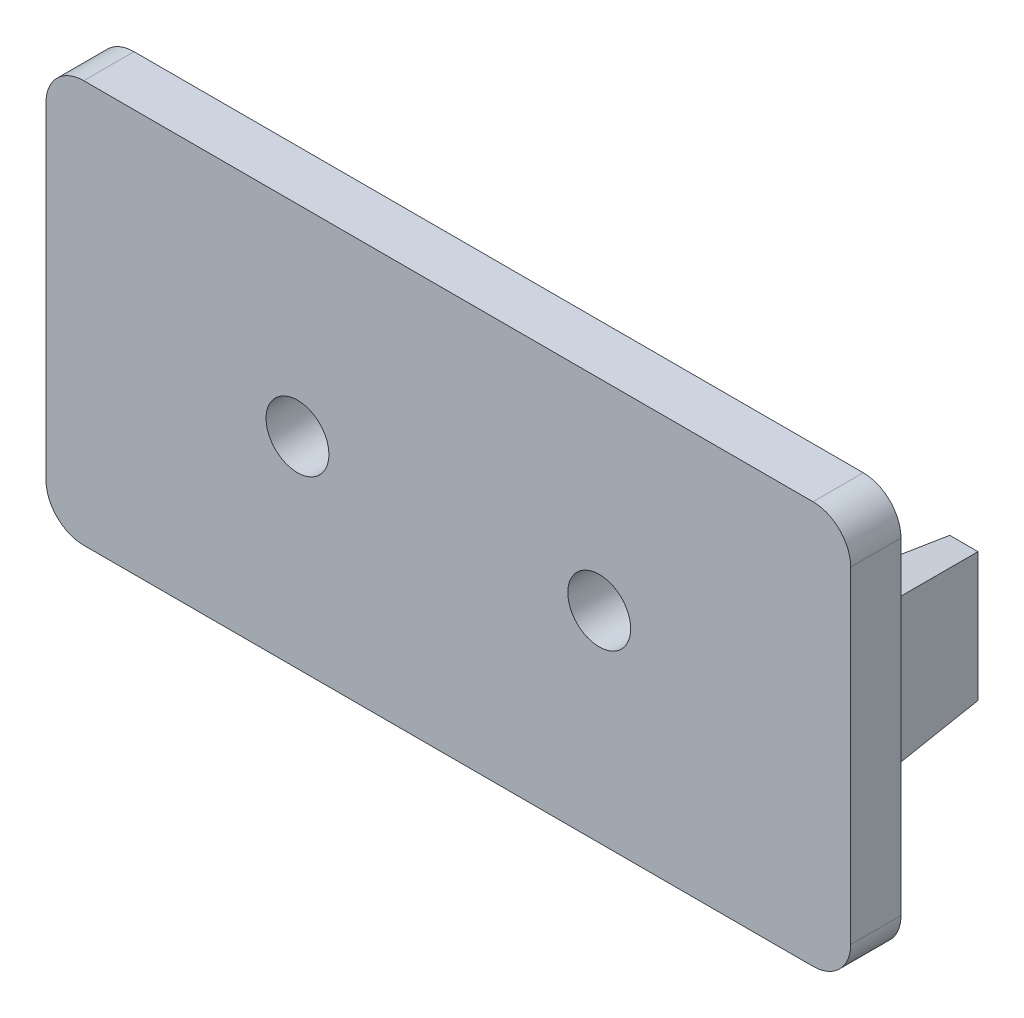
ISO-10303-21;
HEADER;
FILE_DESCRIPTION(('STEP AP214'),'2;1');
FILE_NAME('part.step','',(''),(''),'','','');
FILE_SCHEMA(('AUTOMOTIVE_DESIGN { 1 0 10303 214 1 1 1 1 }'));
ENDSEC;
DATA;
#1=APPLICATION_CONTEXT('core data for automotive mechanical design processes');
#2=APPLICATION_PROTOCOL_DEFINITION('international standard','automotive_design',2000,#1);
#3=PRODUCT_CONTEXT('',#1,'mechanical');
#4=PRODUCT('Part','Part','',(#3));
#5=PRODUCT_RELATED_PRODUCT_CATEGORY('part','',(#4));
#6=PRODUCT_DEFINITION_FORMATION('','',#4);
#7=PRODUCT_DEFINITION_CONTEXT('part definition',#1,'design');
#8=PRODUCT_DEFINITION('design','',#6,#7);
#9=PRODUCT_DEFINITION_SHAPE('','',#8);
#10=(LENGTH_UNIT() NAMED_UNIT(*) SI_UNIT(.MILLI.,.METRE.));
#11=(NAMED_UNIT(*) PLANE_ANGLE_UNIT() SI_UNIT($,.RADIAN.));
#12=(NAMED_UNIT(*) SI_UNIT($,.STERADIAN.) SOLID_ANGLE_UNIT());
#13=UNCERTAINTY_MEASURE_WITH_UNIT(LENGTH_MEASURE(1.E-05),#10,'distance_accuracy_value','');
#14=(GEOMETRIC_REPRESENTATION_CONTEXT(3) GLOBAL_UNCERTAINTY_ASSIGNED_CONTEXT((#13)) GLOBAL_UNIT_ASSIGNED_CONTEXT((#10,
#11,#12)) REPRESENTATION_CONTEXT('',''));
#15=CARTESIAN_POINT('',(0.,0.,0.));
#16=DIRECTION('',(0.,0.,1.));
#17=DIRECTION('',(1.,0.,0.));
#18=AXIS2_PLACEMENT_3D('',#15,#16,#17);
#19=CARTESIAN_POINT('',(0.,0.,0.));
#20=DIRECTION('',(0.,0.,1.));
#21=DIRECTION('',(1.,0.,0.));
#22=AXIS2_PLACEMENT_3D('',#19,#20,#21);
#23=PLANE('',#22);
#24=DIRECTION('',(0.,-1.,0.));
#25=VECTOR('',#24,1.);
#26=CARTESIAN_POINT('',(14.5,3.,0.));
#27=LINE('',#26,#25);
#28=CARTESIAN_POINT('',(14.5,3.,0.));
#29=VERTEX_POINT('',#28);
#30=CARTESIAN_POINT('',(14.5,-3.,0.));
#31=VERTEX_POINT('',#30);
#32=EDGE_CURVE('E186',#29,#31,#27,.T.);
#33=ORIENTED_EDGE('',*,*,#32,.F.);
#34=DIRECTION('',(1.,0.,0.));
#35=VECTOR('',#34,1.);
#36=CARTESIAN_POINT('',(14.5,3.,0.));
#37=LINE('',#36,#35);
#38=CARTESIAN_POINT('',(12.5,3.,0.));
#39=VERTEX_POINT('',#38);
#40=EDGE_CURVE('E195',#39,#29,#37,.T.);
#41=ORIENTED_EDGE('',*,*,#40,.F.);
#42=DIRECTION('',(0.,1.,0.));
#43=VECTOR('',#42,1.);
#44=CARTESIAN_POINT('',(12.5,3.,0.));
#45=LINE('',#44,#43);
#46=CARTESIAN_POINT('',(12.5,-3.,0.));
#47=VERTEX_POINT('',#46);
#48=EDGE_CURVE('E192',#47,#39,#45,.T.);
#49=ORIENTED_EDGE('',*,*,#48,.F.);
#50=DIRECTION('',(-1.,0.,0.));
#51=VECTOR('',#50,1.);
#52=CARTESIAN_POINT('',(14.5,-3.,0.));
#53=LINE('',#52,#51);
#54=EDGE_CURVE('E189',#31,#47,#53,.T.);
#55=ORIENTED_EDGE('',*,*,#54,.F.);
#56=EDGE_LOOP('',(#33,#41,#49,#55));
#57=FACE_BOUND('',#56,.T.);
#58=DIRECTION('',(1.,0.,0.));
#59=VECTOR('',#58,1.);
#60=CARTESIAN_POINT('',(-16.,-8.,0.));
#61=LINE('',#60,#59);
#62=CARTESIAN_POINT('',(-14.5,-8.,0.));
#63=VERTEX_POINT('',#62);
#64=CARTESIAN_POINT('',(14.5,-8.,0.));
#65=VERTEX_POINT('',#64);
#66=EDGE_CURVE('E246',#63,#65,#61,.T.);
#67=ORIENTED_EDGE('',*,*,#66,.F.);
#68=CARTESIAN_POINT('',(-14.5,-6.5,0.));
#69=DIRECTION('',(0.,0.,1.));
#70=DIRECTION('',(1.,0.,0.));
#71=AXIS2_PLACEMENT_3D('',#68,#69,#70);
#72=CIRCLE('',#71,1.5);
#73=CARTESIAN_POINT('',(-16.,-6.5,0.));
#74=VERTEX_POINT('',#73);
#75=EDGE_CURVE('E263',#63,#74,#72,.F.);
#76=ORIENTED_EDGE('',*,*,#75,.T.);
#77=DIRECTION('',(0.,-1.,0.));
#78=VECTOR('',#77,1.);
#79=CARTESIAN_POINT('',(-16.,8.,0.));
#80=LINE('',#79,#78);
#81=CARTESIAN_POINT('',(-16.,6.5,0.));
#82=VERTEX_POINT('',#81);
#83=EDGE_CURVE('E229',#82,#74,#80,.T.);
#84=ORIENTED_EDGE('',*,*,#83,.F.);
#85=CARTESIAN_POINT('',(-14.5,6.5,0.));
#86=DIRECTION('',(0.,0.,1.));
#87=DIRECTION('',(1.,0.,0.));
#88=AXIS2_PLACEMENT_3D('',#85,#86,#87);
#89=CIRCLE('',#88,1.5);
#90=CARTESIAN_POINT('',(-14.5,8.,0.));
#91=VERTEX_POINT('',#90);
#92=EDGE_CURVE('E261',#82,#91,#89,.F.);
#93=ORIENTED_EDGE('',*,*,#92,.T.);
#94=DIRECTION('',(-1.,0.,0.));
#95=VECTOR('',#94,1.);
#96=CARTESIAN_POINT('',(-16.,8.,0.));
#97=LINE('',#96,#95);
#98=CARTESIAN_POINT('',(14.5,8.,0.));
#99=VERTEX_POINT('',#98);
#100=EDGE_CURVE('E236',#99,#91,#97,.T.);
#101=ORIENTED_EDGE('',*,*,#100,.F.);
#102=CARTESIAN_POINT('',(14.5,6.5,0.));
#103=DIRECTION('',(0.,0.,1.));
#104=DIRECTION('',(1.,0.,0.));
#105=AXIS2_PLACEMENT_3D('',#102,#103,#104);
#106=CIRCLE('',#105,1.5);
#107=CARTESIAN_POINT('',(16.,6.5,0.));
#108=VERTEX_POINT('',#107);
#109=EDGE_CURVE('E259',#99,#108,#106,.F.);
#110=ORIENTED_EDGE('',*,*,#109,.T.);
#111=DIRECTION('',(0.,1.,0.));
#112=VECTOR('',#111,1.);
#113=CARTESIAN_POINT('',(16.,8.,0.));
#114=LINE('',#113,#112);
#115=CARTESIAN_POINT('',(16.,-6.5,0.));
#116=VERTEX_POINT('',#115);
#117=EDGE_CURVE('E249',#116,#108,#114,.T.);
#118=ORIENTED_EDGE('',*,*,#117,.F.);
#119=CARTESIAN_POINT('',(14.5,-6.5,0.));
#120=DIRECTION('',(0.,0.,1.));
#121=DIRECTION('',(1.,0.,0.));
#122=AXIS2_PLACEMENT_3D('',#119,#120,#121);
#123=CIRCLE('',#122,1.5);
#124=EDGE_CURVE('E257',#116,#65,#123,.F.);
#125=ORIENTED_EDGE('',*,*,#124,.T.);
#126=EDGE_LOOP('',(#67,#76,#84,#93,#101,#110,#118,#125));
#127=FACE_BOUND('',#126,.T.);
#128=CARTESIAN_POINT('',(6.,0.,0.));
#129=DIRECTION('',(0.,0.,1.));
#130=DIRECTION('',(1.,0.,0.));
#131=AXIS2_PLACEMENT_3D('',#128,#129,#130);
#132=CIRCLE('',#131,1.25);
#133=CARTESIAN_POINT('',(7.25,0.,0.));
#134=VERTEX_POINT('',#133);
#135=EDGE_CURVE('E223',#134,#134,#132,.T.);
#136=ORIENTED_EDGE('',*,*,#135,.T.);
#137=EDGE_LOOP('',(#136));
#138=FACE_BOUND('',#137,.T.);
#139=CARTESIAN_POINT('',(-6.,0.,0.));
#140=DIRECTION('',(0.,0.,1.));
#141=DIRECTION('',(1.,0.,0.));
#142=AXIS2_PLACEMENT_3D('',#139,#140,#141);
#143=CIRCLE('',#142,1.25);
#144=CARTESIAN_POINT('',(-4.75,0.,0.));
#145=VERTEX_POINT('',#144);
#146=EDGE_CURVE('E202',#145,#145,#143,.T.);
#147=ORIENTED_EDGE('',*,*,#146,.T.);
#148=EDGE_LOOP('',(#147));
#149=FACE_BOUND('',#148,.T.);
#150=DIRECTION('',(0.,-1.,0.));
#151=VECTOR('',#150,1.);
#152=CARTESIAN_POINT('',(-12.5,3.,0.));
#153=LINE('',#152,#151);
#154=CARTESIAN_POINT('',(-12.5,3.,0.));
#155=VERTEX_POINT('',#154);
#156=CARTESIAN_POINT('',(-12.5,-3.,0.));
#157=VERTEX_POINT('',#156);
#158=EDGE_CURVE('E146',#155,#157,#153,.T.);
#159=ORIENTED_EDGE('',*,*,#158,.F.);
#160=DIRECTION('',(1.,0.,0.));
#161=VECTOR('',#160,1.);
#162=CARTESIAN_POINT('',(-12.5,3.,0.));
#163=LINE('',#162,#161);
#164=CARTESIAN_POINT('',(-14.5,3.,0.));
#165=VERTEX_POINT('',#164);
#166=EDGE_CURVE('E148',#165,#155,#163,.T.);
#167=ORIENTED_EDGE('',*,*,#166,.F.);
#168=DIRECTION('',(0.,1.,0.));
#169=VECTOR('',#168,1.);
#170=CARTESIAN_POINT('',(-14.5,3.,0.));
#171=LINE('',#170,#169);
#172=CARTESIAN_POINT('',(-14.5,-3.,0.));
#173=VERTEX_POINT('',#172);
#174=EDGE_CURVE('E167',#173,#165,#171,.T.);
#175=ORIENTED_EDGE('',*,*,#174,.F.);
#176=DIRECTION('',(-1.,0.,0.));
#177=VECTOR('',#176,1.);
#178=CARTESIAN_POINT('',(-12.5,-3.,0.));
#179=LINE('',#178,#177);
#180=EDGE_CURVE('E151',#157,#173,#179,.T.);
#181=ORIENTED_EDGE('',*,*,#180,.F.);
#182=EDGE_LOOP('',(#159,#167,#175,#181));
#183=FACE_BOUND('',#182,.T.);
#184=ADVANCED_FACE('F33',(#57,#127,#138,#149,#183),#23,.F.);
#185=CARTESIAN_POINT('',(0.,0.,2.));
#186=DIRECTION('',(0.,0.,1.));
#187=DIRECTION('',(1.,0.,0.));
#188=AXIS2_PLACEMENT_3D('',#185,#186,#187);
#189=PLANE('',#188);
#190=CARTESIAN_POINT('',(6.,0.,2.));
#191=DIRECTION('',(0.,0.,1.));
#192=DIRECTION('',(1.,0.,0.));
#193=AXIS2_PLACEMENT_3D('',#190,#191,#192);
#194=CIRCLE('',#193,1.25);
#195=CARTESIAN_POINT('',(7.25,0.,2.));
#196=VERTEX_POINT('',#195);
#197=EDGE_CURVE('E226',#196,#196,#194,.T.);
#198=ORIENTED_EDGE('',*,*,#197,.F.);
#199=EDGE_LOOP('',(#198));
#200=FACE_BOUND('',#199,.T.);
#201=DIRECTION('',(0.,-1.,0.));
#202=VECTOR('',#201,1.);
#203=CARTESIAN_POINT('',(-16.,8.,2.));
#204=LINE('',#203,#202);
#205=CARTESIAN_POINT('',(-16.,6.5,2.));
#206=VERTEX_POINT('',#205);
#207=CARTESIAN_POINT('',(-16.,-6.5,2.));
#208=VERTEX_POINT('',#207);
#209=EDGE_CURVE('E232',#206,#208,#204,.T.);
#210=ORIENTED_EDGE('',*,*,#209,.T.);
#211=CARTESIAN_POINT('',(-14.5,-6.5,2.));
#212=DIRECTION('',(0.,0.,1.));
#213=DIRECTION('',(1.,0.,0.));
#214=AXIS2_PLACEMENT_3D('',#211,#212,#213);
#215=CIRCLE('',#214,1.5);
#216=CARTESIAN_POINT('',(-14.5,-8.,2.));
#217=VERTEX_POINT('',#216);
#218=EDGE_CURVE('E275',#208,#217,#215,.T.);
#219=ORIENTED_EDGE('',*,*,#218,.T.);
#220=DIRECTION('',(1.,0.,0.));
#221=VECTOR('',#220,1.);
#222=CARTESIAN_POINT('',(-16.,-8.,2.));
#223=LINE('',#222,#221);
#224=CARTESIAN_POINT('',(14.5,-8.,2.));
#225=VERTEX_POINT('',#224);
#226=EDGE_CURVE('E235',#217,#225,#223,.T.);
#227=ORIENTED_EDGE('',*,*,#226,.T.);
#228=CARTESIAN_POINT('',(14.5,-6.5,2.));
#229=DIRECTION('',(0.,0.,1.));
#230=DIRECTION('',(1.,0.,0.));
#231=AXIS2_PLACEMENT_3D('',#228,#229,#230);
#232=CIRCLE('',#231,1.5);
#233=CARTESIAN_POINT('',(16.,-6.5,2.));
#234=VERTEX_POINT('',#233);
#235=EDGE_CURVE('E270',#225,#234,#232,.T.);
#236=ORIENTED_EDGE('',*,*,#235,.T.);
#237=DIRECTION('',(0.,1.,0.));
#238=VECTOR('',#237,1.);
#239=CARTESIAN_POINT('',(16.,8.,2.));
#240=LINE('',#239,#238);
#241=CARTESIAN_POINT('',(16.,6.5,2.));
#242=VERTEX_POINT('',#241);
#243=EDGE_CURVE('E239',#234,#242,#240,.T.);
#244=ORIENTED_EDGE('',*,*,#243,.T.);
#245=CARTESIAN_POINT('',(14.5,6.5,2.));
#246=DIRECTION('',(0.,0.,1.));
#247=DIRECTION('',(1.,0.,0.));
#248=AXIS2_PLACEMENT_3D('',#245,#246,#247);
#249=CIRCLE('',#248,1.5);
#250=CARTESIAN_POINT('',(14.5,8.,2.));
#251=VERTEX_POINT('',#250);
#252=EDGE_CURVE('E55',#242,#251,#249,.T.);
#253=ORIENTED_EDGE('',*,*,#252,.T.);
#254=DIRECTION('',(-1.,0.,0.));
#255=VECTOR('',#254,1.);
#256=CARTESIAN_POINT('',(-16.,8.,2.));
#257=LINE('',#256,#255);
#258=CARTESIAN_POINT('',(-14.5,8.,2.));
#259=VERTEX_POINT('',#258);
#260=EDGE_CURVE('E241',#251,#259,#257,.T.);
#261=ORIENTED_EDGE('',*,*,#260,.T.);
#262=CARTESIAN_POINT('',(-14.5,6.5,2.));
#263=DIRECTION('',(0.,0.,1.));
#264=DIRECTION('',(1.,0.,0.));
#265=AXIS2_PLACEMENT_3D('',#262,#263,#264);
#266=CIRCLE('',#265,1.5);
#267=EDGE_CURVE('E273',#259,#206,#266,.T.);
#268=ORIENTED_EDGE('',*,*,#267,.T.);
#269=EDGE_LOOP('',(#210,#219,#227,#236,#244,#253,#261,#268));
#270=FACE_BOUND('',#269,.T.);
#271=CARTESIAN_POINT('',(-6.,0.,2.));
#272=DIRECTION('',(0.,0.,1.));
#273=DIRECTION('',(1.,0.,0.));
#274=AXIS2_PLACEMENT_3D('',#271,#272,#273);
#275=CIRCLE('',#274,1.25);
#276=CARTESIAN_POINT('',(-4.75,0.,2.));
#277=VERTEX_POINT('',#276);
#278=EDGE_CURVE('E220',#277,#277,#275,.T.);
#279=ORIENTED_EDGE('',*,*,#278,.F.);
#280=EDGE_LOOP('',(#279));
#281=FACE_BOUND('',#280,.T.);
#282=ADVANCED_FACE('F298',(#200,#270,#281),#189,.T.);
#283=CARTESIAN_POINT('',(-16.,8.,2.));
#284=DIRECTION('',(1.,0.,0.));
#285=DIRECTION('',(0.,1.,0.));
#286=AXIS2_PLACEMENT_3D('',#283,#284,#285);
#287=PLANE('',#286);
#288=ORIENTED_EDGE('',*,*,#83,.T.);
#289=DIRECTION('',(0.,0.,-1.));
#290=VECTOR('',#289,1.);
#291=CARTESIAN_POINT('',(-16.,-6.5,2.));
#292=LINE('',#291,#290);
#293=EDGE_CURVE('E268',#74,#208,#292,.F.);
#294=ORIENTED_EDGE('',*,*,#293,.T.);
#295=ORIENTED_EDGE('',*,*,#209,.F.);
#296=DIRECTION('',(0.,0.,-1.));
#297=VECTOR('',#296,1.);
#298=CARTESIAN_POINT('',(-16.,6.5,2.));
#299=LINE('',#298,#297);
#300=EDGE_CURVE('E265',#206,#82,#299,.T.);
#301=ORIENTED_EDGE('',*,*,#300,.T.);
#302=EDGE_LOOP('',(#288,#294,#295,#301));
#303=FACE_BOUND('',#302,.T.);
#304=ADVANCED_FACE('F306',(#303),#287,.F.);
#305=CARTESIAN_POINT('',(-16.,-8.,2.));
#306=DIRECTION('',(0.,1.,0.));
#307=DIRECTION('',(0.,0.,1.));
#308=AXIS2_PLACEMENT_3D('',#305,#306,#307);
#309=PLANE('',#308);
#310=ORIENTED_EDGE('',*,*,#226,.F.);
#311=DIRECTION('',(0.,0.,-1.));
#312=VECTOR('',#311,1.);
#313=CARTESIAN_POINT('',(-14.5,-8.,2.));
#314=LINE('',#313,#312);
#315=EDGE_CURVE('E254',#217,#63,#314,.T.);
#316=ORIENTED_EDGE('',*,*,#315,.T.);
#317=ORIENTED_EDGE('',*,*,#66,.T.);
#318=DIRECTION('',(0.,0.,-1.));
#319=VECTOR('',#318,1.);
#320=CARTESIAN_POINT('',(14.5,-8.,2.));
#321=LINE('',#320,#319);
#322=EDGE_CURVE('E243',#65,#225,#321,.F.);
#323=ORIENTED_EDGE('',*,*,#322,.T.);
#324=EDGE_LOOP('',(#310,#316,#317,#323));
#325=FACE_BOUND('',#324,.T.);
#326=ADVANCED_FACE('F314',(#325),#309,.F.);
#327=CARTESIAN_POINT('',(16.,8.,2.));
#328=DIRECTION('',(-1.,0.,0.));
#329=DIRECTION('',(0.,-1.,0.));
#330=AXIS2_PLACEMENT_3D('',#327,#328,#329);
#331=PLANE('',#330);
#332=ORIENTED_EDGE('',*,*,#117,.T.);
#333=DIRECTION('',(0.,0.,-1.));
#334=VECTOR('',#333,1.);
#335=CARTESIAN_POINT('',(16.,6.5,2.));
#336=LINE('',#335,#334);
#337=EDGE_CURVE('E11',#108,#242,#336,.F.);
#338=ORIENTED_EDGE('',*,*,#337,.T.);
#339=ORIENTED_EDGE('',*,*,#243,.F.);
#340=DIRECTION('',(0.,0.,-1.));
#341=VECTOR('',#340,1.);
#342=CARTESIAN_POINT('',(16.,-6.5,2.));
#343=LINE('',#342,#341);
#344=EDGE_CURVE('E41',#234,#116,#343,.T.);
#345=ORIENTED_EDGE('',*,*,#344,.T.);
#346=EDGE_LOOP('',(#332,#338,#339,#345));
#347=FACE_BOUND('',#346,.T.);
#348=ADVANCED_FACE('F285',(#347),#331,.F.);
#349=CARTESIAN_POINT('',(-16.,8.,2.));
#350=DIRECTION('',(0.,-1.,0.));
#351=DIRECTION('',(0.,0.,-1.));
#352=AXIS2_PLACEMENT_3D('',#349,#350,#351);
#353=PLANE('',#352);
#354=ORIENTED_EDGE('',*,*,#100,.T.);
#355=DIRECTION('',(0.,0.,-1.));
#356=VECTOR('',#355,1.);
#357=CARTESIAN_POINT('',(-14.5,8.,2.));
#358=LINE('',#357,#356);
#359=EDGE_CURVE('E48',#91,#259,#358,.F.);
#360=ORIENTED_EDGE('',*,*,#359,.T.);
#361=ORIENTED_EDGE('',*,*,#260,.F.);
#362=DIRECTION('',(0.,0.,-1.));
#363=VECTOR('',#362,1.);
#364=CARTESIAN_POINT('',(14.5,8.,2.));
#365=LINE('',#364,#363);
#366=EDGE_CURVE('E277',#251,#99,#365,.T.);
#367=ORIENTED_EDGE('',*,*,#366,.T.);
#368=EDGE_LOOP('',(#354,#360,#361,#367));
#369=FACE_BOUND('',#368,.T.);
#370=ADVANCED_FACE('F296',(#369),#353,.F.);
#371=CARTESIAN_POINT('',(6.,0.,2.));
#372=DIRECTION('',(0.,0.,-1.));
#373=DIRECTION('',(-1.,0.,0.));
#374=AXIS2_PLACEMENT_3D('',#371,#372,#373);
#375=CYLINDRICAL_SURFACE('',#374,1.25);
#376=ORIENTED_EDGE('',*,*,#197,.T.);
#377=EDGE_LOOP('',(#376));
#378=FACE_BOUND('',#377,.T.);
#379=ORIENTED_EDGE('',*,*,#135,.F.);
#380=EDGE_LOOP('',(#379));
#381=FACE_BOUND('',#380,.T.);
#382=ADVANCED_FACE('F332',(#378,#381),#375,.F.);
#383=CARTESIAN_POINT('',(-6.,0.,2.));
#384=DIRECTION('',(0.,0.,-1.));
#385=DIRECTION('',(-1.,0.,0.));
#386=AXIS2_PLACEMENT_3D('',#383,#384,#385);
#387=CYLINDRICAL_SURFACE('',#386,1.25);
#388=ORIENTED_EDGE('',*,*,#278,.T.);
#389=EDGE_LOOP('',(#388));
#390=FACE_BOUND('',#389,.T.);
#391=ORIENTED_EDGE('',*,*,#146,.F.);
#392=EDGE_LOOP('',(#391));
#393=FACE_BOUND('',#392,.T.);
#394=ADVANCED_FACE('F449',(#390,#393),#387,.F.);
#395=CARTESIAN_POINT('',(14.5,3.,0.));
#396=DIRECTION('',(0.996194698091746,0.,-0.0871557427476582));
#397=DIRECTION('',(-0.0871557427476582,0.,-0.996194698091746));
#398=AXIS2_PLACEMENT_3D('',#395,#396,#397);
#399=PLANE('',#398);
#400=ORIENTED_EDGE('',*,*,#32,.T.);
#401=DIRECTION('',(0.0868265938642476,-0.0868265938642476,0.992432509138967));
#402=VECTOR('',#401,1.);
#403=CARTESIAN_POINT('',(14.5,-3.,0.));
#404=LINE('',#403,#402);
#405=CARTESIAN_POINT('',(14.0625566823704,-2.56255668237038,-5.));
#406=VERTEX_POINT('',#405);
#407=EDGE_CURVE('E199',#406,#31,#404,.T.);
#408=ORIENTED_EDGE('',*,*,#407,.F.);
#409=DIRECTION('',(0.,1.,0.));
#410=VECTOR('',#409,1.);
#411=CARTESIAN_POINT('',(14.0625566823704,3.,-5.));
#412=LINE('',#411,#410);
#413=CARTESIAN_POINT('',(14.0625566823704,2.56255668237038,-5.));
#414=VERTEX_POINT('',#413);
#415=EDGE_CURVE('E198',#414,#406,#412,.F.);
#416=ORIENTED_EDGE('',*,*,#415,.F.);
#417=DIRECTION('',(0.0868265938642476,0.0868265938642476,0.992432509138967));
#418=VECTOR('',#417,1.);
#419=CARTESIAN_POINT('',(14.5,3.,0.));
#420=LINE('',#419,#418);
#421=EDGE_CURVE('E204',#414,#29,#420,.T.);
#422=ORIENTED_EDGE('',*,*,#421,.T.);
#423=EDGE_LOOP('',(#400,#408,#416,#422));
#424=FACE_BOUND('',#423,.T.);
#425=ADVANCED_FACE('F440',(#424),#399,.T.);
#426=CARTESIAN_POINT('',(14.5,-3.,0.));
#427=DIRECTION('',(0.,-0.996194698091746,-0.0871557427476582));
#428=DIRECTION('',(0.,0.0871557427476582,-0.996194698091746));
#429=AXIS2_PLACEMENT_3D('',#426,#427,#428);
#430=PLANE('',#429);
#431=ORIENTED_EDGE('',*,*,#54,.T.);
#432=DIRECTION('',(-0.0868265938642476,-0.0868265938642476,0.992432509138967));
#433=VECTOR('',#432,1.);
#434=CARTESIAN_POINT('',(12.5452331444124,-2.9547668555876,-0.517017206452112));
#435=LINE('',#434,#433);
#436=CARTESIAN_POINT('',(12.9374433176296,-2.56255668237038,-5.));
#437=VERTEX_POINT('',#436);
#438=EDGE_CURVE('E203',#437,#47,#435,.T.);
#439=ORIENTED_EDGE('',*,*,#438,.F.);
#440=DIRECTION('',(1.,0.,0.));
#441=VECTOR('',#440,1.);
#442=CARTESIAN_POINT('',(14.5,-2.56255668237038,-5.));
#443=LINE('',#442,#441);
#444=EDGE_CURVE('E215',#406,#437,#443,.F.);
#445=ORIENTED_EDGE('',*,*,#444,.F.);
#446=ORIENTED_EDGE('',*,*,#407,.T.);
#447=EDGE_LOOP('',(#431,#439,#445,#446));
#448=FACE_BOUND('',#447,.T.);
#449=ADVANCED_FACE('F431',(#448),#430,.T.);
#450=CARTESIAN_POINT('',(12.5,3.,0.));
#451=DIRECTION('',(-0.996194698091746,0.,-0.0871557427476582));
#452=DIRECTION('',(-0.0871557427476582,0.,0.996194698091746));
#453=AXIS2_PLACEMENT_3D('',#450,#451,#452);
#454=PLANE('',#453);
#455=ORIENTED_EDGE('',*,*,#48,.T.);
#456=DIRECTION('',(-0.0868265938642476,0.0868265938642477,0.992432509138967));
#457=VECTOR('',#456,1.);
#458=CARTESIAN_POINT('',(12.5150777148041,2.98492228519587,-0.172339068817371));
#459=LINE('',#458,#457);
#460=CARTESIAN_POINT('',(12.9374433176296,2.56255668237038,-5.));
#461=VERTEX_POINT('',#460);
#462=EDGE_CURVE('E207',#461,#39,#459,.T.);
#463=ORIENTED_EDGE('',*,*,#462,.F.);
#464=DIRECTION('',(0.,-1.,0.));
#465=VECTOR('',#464,1.);
#466=CARTESIAN_POINT('',(12.9374433176296,3.,-5.));
#467=LINE('',#466,#465);
#468=EDGE_CURVE('E217',#437,#461,#467,.F.);
#469=ORIENTED_EDGE('',*,*,#468,.F.);
#470=ORIENTED_EDGE('',*,*,#438,.T.);
#471=EDGE_LOOP('',(#455,#463,#469,#470));
#472=FACE_BOUND('',#471,.T.);
#473=ADVANCED_FACE('F422',(#472),#454,.T.);
#474=CARTESIAN_POINT('',(14.5,3.,0.));
#475=DIRECTION('',(0.,0.996194698091746,-0.0871557427476582));
#476=DIRECTION('',(0.,0.0871557427476582,0.996194698091746));
#477=AXIS2_PLACEMENT_3D('',#474,#475,#476);
#478=PLANE('',#477);
#479=ORIENTED_EDGE('',*,*,#40,.T.);
#480=ORIENTED_EDGE('',*,*,#421,.F.);
#481=DIRECTION('',(-1.,0.,0.));
#482=VECTOR('',#481,1.);
#483=CARTESIAN_POINT('',(14.5,2.56255668237038,-5.));
#484=LINE('',#483,#482);
#485=EDGE_CURVE('E208',#461,#414,#484,.F.);
#486=ORIENTED_EDGE('',*,*,#485,.F.);
#487=ORIENTED_EDGE('',*,*,#462,.T.);
#488=EDGE_LOOP('',(#479,#480,#486,#487));
#489=FACE_BOUND('',#488,.T.);
#490=ADVANCED_FACE('F413',(#489),#478,.T.);
#491=CARTESIAN_POINT('',(0.,0.,-5.));
#492=DIRECTION('',(0.,0.,-1.));
#493=DIRECTION('',(-1.,0.,0.));
#494=AXIS2_PLACEMENT_3D('',#491,#492,#493);
#495=PLANE('',#494);
#496=ORIENTED_EDGE('',*,*,#415,.T.);
#497=ORIENTED_EDGE('',*,*,#444,.T.);
#498=ORIENTED_EDGE('',*,*,#468,.T.);
#499=ORIENTED_EDGE('',*,*,#485,.T.);
#500=EDGE_LOOP('',(#496,#497,#498,#499));
#501=FACE_BOUND('',#500,.T.);
#502=ADVANCED_FACE('F405',(#501),#495,.T.);
#503=CARTESIAN_POINT('',(-12.5,3.,0.));
#504=DIRECTION('',(0.996194698091746,0.,-0.0871557427476582));
#505=DIRECTION('',(-0.0871557427476582,0.,-0.996194698091746));
#506=AXIS2_PLACEMENT_3D('',#503,#504,#505);
#507=PLANE('',#506);
#508=ORIENTED_EDGE('',*,*,#158,.T.);
#509=DIRECTION('',(0.0868265938642476,-0.0868265938642476,0.992432509138967));
#510=VECTOR('',#509,1.);
#511=CARTESIAN_POINT('',(-12.5,-3.,0.));
#512=LINE('',#511,#510);
#513=CARTESIAN_POINT('',(-12.9374433176296,-2.56255668237038,-5.));
#514=VERTEX_POINT('',#513);
#515=EDGE_CURVE('E178',#514,#157,#512,.T.);
#516=ORIENTED_EDGE('',*,*,#515,.F.);
#517=DIRECTION('',(0.,1.,0.));
#518=VECTOR('',#517,1.);
#519=CARTESIAN_POINT('',(-12.9374433176296,3.,-5.));
#520=LINE('',#519,#518);
#521=CARTESIAN_POINT('',(-12.9374433176296,2.56255668237038,-5.));
#522=VERTEX_POINT('',#521);
#523=EDGE_CURVE('E166',#522,#514,#520,.F.);
#524=ORIENTED_EDGE('',*,*,#523,.F.);
#525=DIRECTION('',(0.0868265938642476,0.0868265938642476,0.992432509138967));
#526=VECTOR('',#525,1.);
#527=CARTESIAN_POINT('',(-12.5,3.,0.));
#528=LINE('',#527,#526);
#529=EDGE_CURVE('E162',#522,#155,#528,.T.);
#530=ORIENTED_EDGE('',*,*,#529,.T.);
#531=EDGE_LOOP('',(#508,#516,#524,#530));
#532=FACE_BOUND('',#531,.T.);
#533=ADVANCED_FACE('F169',(#532),#507,.T.);
#534=CARTESIAN_POINT('',(-12.5,-3.,0.));
#535=DIRECTION('',(0.,-0.996194698091746,-0.0871557427476582));
#536=DIRECTION('',(0.,0.0871557427476582,-0.996194698091746));
#537=AXIS2_PLACEMENT_3D('',#534,#535,#536);
#538=PLANE('',#537);
#539=ORIENTED_EDGE('',*,*,#180,.T.);
#540=DIRECTION('',(-0.0868265938642477,-0.0868265938642476,0.992432509138967));
#541=VECTOR('',#540,1.);
#542=CARTESIAN_POINT('',(-14.4547668555876,-2.9547668555876,-0.517017206452112));
#543=LINE('',#542,#541);
#544=CARTESIAN_POINT('',(-14.0625566823704,-2.56255668237038,-5.));
#545=VERTEX_POINT('',#544);
#546=EDGE_CURVE('E173',#545,#173,#543,.T.);
#547=ORIENTED_EDGE('',*,*,#546,.F.);
#548=DIRECTION('',(1.,0.,0.));
#549=VECTOR('',#548,1.);
#550=CARTESIAN_POINT('',(-12.5,-2.56255668237038,-5.));
#551=LINE('',#550,#549);
#552=EDGE_CURVE('E183',#514,#545,#551,.F.);
#553=ORIENTED_EDGE('',*,*,#552,.F.);
#554=ORIENTED_EDGE('',*,*,#515,.T.);
#555=EDGE_LOOP('',(#539,#547,#553,#554));
#556=FACE_BOUND('',#555,.T.);
#557=ADVANCED_FACE('F388',(#556),#538,.T.);
#558=CARTESIAN_POINT('',(-14.5,3.,0.));
#559=DIRECTION('',(-0.996194698091746,0.,-0.0871557427476582));
#560=DIRECTION('',(-0.0871557427476582,0.,0.996194698091746));
#561=AXIS2_PLACEMENT_3D('',#558,#559,#560);
#562=PLANE('',#561);
#563=ORIENTED_EDGE('',*,*,#174,.T.);
#564=DIRECTION('',(-0.0868265938642476,0.0868265938642476,0.992432509138967));
#565=VECTOR('',#564,1.);
#566=CARTESIAN_POINT('',(-14.4849222851959,2.98492228519587,-0.17233906881737));
#567=LINE('',#566,#565);
#568=CARTESIAN_POINT('',(-14.0625566823704,2.56255668237038,-5.));
#569=VERTEX_POINT('',#568);
#570=EDGE_CURVE('E165',#569,#165,#567,.T.);
#571=ORIENTED_EDGE('',*,*,#570,.F.);
#572=DIRECTION('',(0.,-1.,0.));
#573=VECTOR('',#572,1.);
#574=CARTESIAN_POINT('',(-14.0625566823704,3.,-5.));
#575=LINE('',#574,#573);
#576=EDGE_CURVE('E175',#545,#569,#575,.F.);
#577=ORIENTED_EDGE('',*,*,#576,.F.);
#578=ORIENTED_EDGE('',*,*,#546,.T.);
#579=EDGE_LOOP('',(#563,#571,#577,#578));
#580=FACE_BOUND('',#579,.T.);
#581=ADVANCED_FACE('F380',(#580),#562,.T.);
#582=CARTESIAN_POINT('',(-12.5,3.,0.));
#583=DIRECTION('',(0.,0.996194698091746,-0.0871557427476582));
#584=DIRECTION('',(0.,0.0871557427476582,0.996194698091746));
#585=AXIS2_PLACEMENT_3D('',#582,#583,#584);
#586=PLANE('',#585);
#587=ORIENTED_EDGE('',*,*,#166,.T.);
#588=ORIENTED_EDGE('',*,*,#529,.F.);
#589=DIRECTION('',(-1.,0.,0.));
#590=VECTOR('',#589,1.);
#591=CARTESIAN_POINT('',(-12.5,2.56255668237038,-5.));
#592=LINE('',#591,#590);
#593=EDGE_CURVE('E171',#569,#522,#592,.F.);
#594=ORIENTED_EDGE('',*,*,#593,.F.);
#595=ORIENTED_EDGE('',*,*,#570,.T.);
#596=EDGE_LOOP('',(#587,#588,#594,#595));
#597=FACE_BOUND('',#596,.T.);
#598=ADVANCED_FACE('F160',(#597),#586,.T.);
#599=CARTESIAN_POINT('',(0.,0.,-5.));
#600=DIRECTION('',(0.,0.,-1.));
#601=DIRECTION('',(-1.,0.,0.));
#602=AXIS2_PLACEMENT_3D('',#599,#600,#601);
#603=PLANE('',#602);
#604=ORIENTED_EDGE('',*,*,#523,.T.);
#605=ORIENTED_EDGE('',*,*,#552,.T.);
#606=ORIENTED_EDGE('',*,*,#576,.T.);
#607=ORIENTED_EDGE('',*,*,#593,.T.);
#608=EDGE_LOOP('',(#604,#605,#606,#607));
#609=FACE_BOUND('',#608,.T.);
#610=ADVANCED_FACE('F341',(#609),#603,.T.);
#611=CARTESIAN_POINT('',(-14.5,-6.5,2.));
#612=DIRECTION('',(0.,0.,-1.));
#613=DIRECTION('',(-1.,0.,0.));
#614=AXIS2_PLACEMENT_3D('',#611,#612,#613);
#615=CYLINDRICAL_SURFACE('',#614,1.5);
#616=ORIENTED_EDGE('',*,*,#218,.F.);
#617=ORIENTED_EDGE('',*,*,#293,.F.);
#618=ORIENTED_EDGE('',*,*,#75,.F.);
#619=ORIENTED_EDGE('',*,*,#315,.F.);
#620=EDGE_LOOP('',(#616,#617,#618,#619));
#621=FACE_BOUND('',#620,.T.);
#622=ADVANCED_FACE('F311',(#621),#615,.T.);
#623=CARTESIAN_POINT('',(-14.5,6.5,2.));
#624=DIRECTION('',(0.,0.,-1.));
#625=DIRECTION('',(-1.,0.,0.));
#626=AXIS2_PLACEMENT_3D('',#623,#624,#625);
#627=CYLINDRICAL_SURFACE('',#626,1.5);
#628=ORIENTED_EDGE('',*,*,#267,.F.);
#629=ORIENTED_EDGE('',*,*,#359,.F.);
#630=ORIENTED_EDGE('',*,*,#92,.F.);
#631=ORIENTED_EDGE('',*,*,#300,.F.);
#632=EDGE_LOOP('',(#628,#629,#630,#631));
#633=FACE_BOUND('',#632,.T.);
#634=ADVANCED_FACE('F303',(#633),#627,.T.);
#635=CARTESIAN_POINT('',(14.5,6.5,2.));
#636=DIRECTION('',(0.,0.,-1.));
#637=DIRECTION('',(-1.,0.,0.));
#638=AXIS2_PLACEMENT_3D('',#635,#636,#637);
#639=CYLINDRICAL_SURFACE('',#638,1.5);
#640=ORIENTED_EDGE('',*,*,#252,.F.);
#641=ORIENTED_EDGE('',*,*,#337,.F.);
#642=ORIENTED_EDGE('',*,*,#109,.F.);
#643=ORIENTED_EDGE('',*,*,#366,.F.);
#644=EDGE_LOOP('',(#640,#641,#642,#643));
#645=FACE_BOUND('',#644,.T.);
#646=ADVANCED_FACE('F295',(#645),#639,.T.);
#647=CARTESIAN_POINT('',(14.5,-6.5,2.));
#648=DIRECTION('',(0.,0.,-1.));
#649=DIRECTION('',(-1.,0.,0.));
#650=AXIS2_PLACEMENT_3D('',#647,#648,#649);
#651=CYLINDRICAL_SURFACE('',#650,1.5);
#652=ORIENTED_EDGE('',*,*,#235,.F.);
#653=ORIENTED_EDGE('',*,*,#322,.F.);
#654=ORIENTED_EDGE('',*,*,#124,.F.);
#655=ORIENTED_EDGE('',*,*,#344,.F.);
#656=EDGE_LOOP('',(#652,#653,#654,#655));
#657=FACE_BOUND('',#656,.T.);
#658=ADVANCED_FACE('F35',(#657),#651,.T.);
#659=CLOSED_SHELL('',(#184,#282,#304,#326,#348,#370,#382,#394,#425,#449,#473,#490,#502,#533,
#557,#581,#598,#610,#622,#634,#646,#658));
#660=MANIFOLD_SOLID_BREP('B2',#659);
#661=ADVANCED_BREP_SHAPE_REPRESENTATION('',(#18,#660),#14);
#662=SHAPE_DEFINITION_REPRESENTATION(#9,#661);
ENDSEC;
END-ISO-10303-21;
